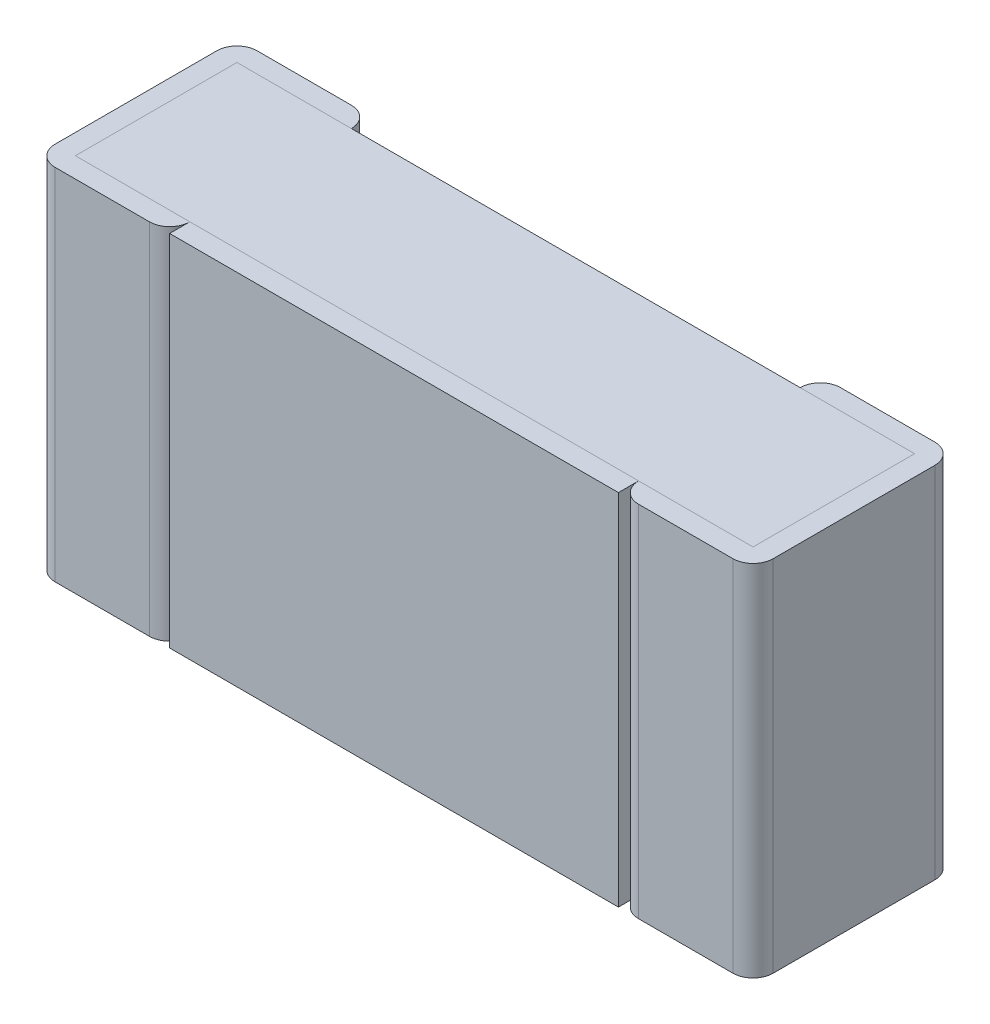
ISO-10303-21;
HEADER;
FILE_DESCRIPTION(('STEP AP214'),'2;1');
FILE_NAME('part.step','',(''),(''),'','','');
FILE_SCHEMA(('AUTOMOTIVE_DESIGN { 1 0 10303 214 1 1 1 1 }'));
ENDSEC;
DATA;
#1=APPLICATION_CONTEXT('core data for automotive mechanical design processes');
#2=APPLICATION_PROTOCOL_DEFINITION('international standard','automotive_design',2000,#1);
#3=PRODUCT_CONTEXT('',#1,'mechanical');
#4=PRODUCT('Part','Part','',(#3));
#5=PRODUCT_RELATED_PRODUCT_CATEGORY('part','',(#4));
#6=PRODUCT_DEFINITION_FORMATION('','',#4);
#7=PRODUCT_DEFINITION_CONTEXT('part definition',#1,'design');
#8=PRODUCT_DEFINITION('design','',#6,#7);
#9=PRODUCT_DEFINITION_SHAPE('','',#8);
#10=(LENGTH_UNIT() NAMED_UNIT(*) SI_UNIT(.MILLI.,.METRE.));
#11=(NAMED_UNIT(*) PLANE_ANGLE_UNIT() SI_UNIT($,.RADIAN.));
#12=(NAMED_UNIT(*) SI_UNIT($,.STERADIAN.) SOLID_ANGLE_UNIT());
#13=UNCERTAINTY_MEASURE_WITH_UNIT(LENGTH_MEASURE(1.E-05),#10,'distance_accuracy_value','');
#14=(GEOMETRIC_REPRESENTATION_CONTEXT(3) GLOBAL_UNCERTAINTY_ASSIGNED_CONTEXT((#13)) GLOBAL_UNIT_ASSIGNED_CONTEXT((#10,
#11,#12)) REPRESENTATION_CONTEXT('',''));
#15=CARTESIAN_POINT('',(0.,0.,0.));
#16=DIRECTION('',(0.,0.,1.));
#17=DIRECTION('',(1.,0.,0.));
#18=AXIS2_PLACEMENT_3D('',#15,#16,#17);
#19=CARTESIAN_POINT('',(-0.5,-0.4,0.45));
#20=DIRECTION('',(0.,0.,1.));
#21=DIRECTION('',(1.,0.,0.));
#22=AXIS2_PLACEMENT_3D('',#19,#20,#21);
#23=PLANE('',#22);
#24=DIRECTION('',(0.,1.,0.));
#25=VECTOR('',#24,1.);
#26=CARTESIAN_POINT('',(-0.5,-0.4,0.45));
#27=LINE('',#26,#25);
#28=CARTESIAN_POINT('',(-0.5,-0.4,0.45));
#29=VERTEX_POINT('',#28);
#30=CARTESIAN_POINT('',(-0.5,0.4,0.45));
#31=VERTEX_POINT('',#30);
#32=EDGE_CURVE('E395',#29,#31,#27,.T.);
#33=ORIENTED_EDGE('',*,*,#32,.F.);
#34=DIRECTION('',(1.,0.,0.));
#35=VECTOR('',#34,1.);
#36=CARTESIAN_POINT('',(-0.5,-0.4,0.45));
#37=LINE('',#36,#35);
#38=CARTESIAN_POINT('',(0.5,-0.4,0.45));
#39=VERTEX_POINT('',#38);
#40=EDGE_CURVE('E355',#29,#39,#37,.T.);
#41=ORIENTED_EDGE('',*,*,#40,.T.);
#42=DIRECTION('',(0.,1.,0.));
#43=VECTOR('',#42,1.);
#44=CARTESIAN_POINT('',(0.5,-0.4,0.45));
#45=LINE('',#44,#43);
#46=CARTESIAN_POINT('',(0.5,0.4,0.45));
#47=VERTEX_POINT('',#46);
#48=EDGE_CURVE('E11',#39,#47,#45,.T.);
#49=ORIENTED_EDGE('',*,*,#48,.T.);
#50=DIRECTION('',(1.,0.,0.));
#51=VECTOR('',#50,1.);
#52=CARTESIAN_POINT('',(-0.5,0.4,0.45));
#53=LINE('',#52,#51);
#54=EDGE_CURVE('E322',#31,#47,#53,.T.);
#55=ORIENTED_EDGE('',*,*,#54,.F.);
#56=EDGE_LOOP('',(#33,#41,#49,#55));
#57=FACE_BOUND('',#56,.T.);
#58=ADVANCED_FACE('F17',(#57),#23,.T.);
#59=CARTESIAN_POINT('',(0.5,-0.4,0.405));
#60=DIRECTION('',(1.,0.,0.));
#61=DIRECTION('',(0.,1.,0.));
#62=AXIS2_PLACEMENT_3D('',#59,#60,#61);
#63=PLANE('',#62);
#64=DIRECTION('',(0.,0.,1.));
#65=VECTOR('',#64,1.);
#66=CARTESIAN_POINT('',(0.5,-0.4,0.405));
#67=LINE('',#66,#65);
#68=CARTESIAN_POINT('',(0.5,-0.4,0.405));
#69=VERTEX_POINT('',#68);
#70=EDGE_CURVE('E351',#69,#39,#67,.T.);
#71=ORIENTED_EDGE('',*,*,#70,.F.);
#72=DIRECTION('',(0.,1.,0.));
#73=VECTOR('',#72,1.);
#74=CARTESIAN_POINT('',(0.5,-0.4,0.405));
#75=LINE('',#74,#73);
#76=CARTESIAN_POINT('',(0.5,0.4,0.405));
#77=VERTEX_POINT('',#76);
#78=EDGE_CURVE('E20',#69,#77,#75,.T.);
#79=ORIENTED_EDGE('',*,*,#78,.T.);
#80=DIRECTION('',(0.,0.,1.));
#81=VECTOR('',#80,1.);
#82=CARTESIAN_POINT('',(0.5,0.4,0.405));
#83=LINE('',#82,#81);
#84=EDGE_CURVE('E318',#77,#47,#83,.T.);
#85=ORIENTED_EDGE('',*,*,#84,.T.);
#86=ORIENTED_EDGE('',*,*,#48,.F.);
#87=EDGE_LOOP('',(#71,#79,#85,#86));
#88=FACE_BOUND('',#87,.T.);
#89=ADVANCED_FACE('F438',(#88),#63,.T.);
#90=CARTESIAN_POINT('',(0.545,-0.4,0.405));
#91=DIRECTION('',(0.,1.,0.));
#92=DIRECTION('',(-1.,0.,0.));
#93=AXIS2_PLACEMENT_3D('',#90,#91,#92);
#94=CYLINDRICAL_SURFACE('',#93,0.045);
#95=CARTESIAN_POINT('',(0.545,-0.4,0.405));
#96=DIRECTION('',(0.,1.,0.));
#97=DIRECTION('',(0.,0.,1.));
#98=AXIS2_PLACEMENT_3D('',#95,#96,#97);
#99=CIRCLE('',#98,0.045);
#100=CARTESIAN_POINT('',(0.545,-0.4,0.45));
#101=VERTEX_POINT('',#100);
#102=EDGE_CURVE('E381',#69,#101,#99,.T.);
#103=ORIENTED_EDGE('',*,*,#102,.T.);
#104=DIRECTION('',(0.,1.,0.));
#105=VECTOR('',#104,1.);
#106=CARTESIAN_POINT('',(0.545,-0.4,0.45));
#107=LINE('',#106,#105);
#108=CARTESIAN_POINT('',(0.545,0.4,0.45));
#109=VERTEX_POINT('',#108);
#110=EDGE_CURVE('E425',#101,#109,#107,.T.);
#111=ORIENTED_EDGE('',*,*,#110,.T.);
#112=CARTESIAN_POINT('',(0.545,0.4,0.405));
#113=DIRECTION('',(0.,1.,0.));
#114=DIRECTION('',(0.,0.,1.));
#115=AXIS2_PLACEMENT_3D('',#112,#113,#114);
#116=CIRCLE('',#115,0.045);
#117=EDGE_CURVE('E323',#77,#109,#116,.T.);
#118=ORIENTED_EDGE('',*,*,#117,.F.);
#119=ORIENTED_EDGE('',*,*,#78,.F.);
#120=EDGE_LOOP('',(#103,#111,#118,#119));
#121=FACE_BOUND('',#120,.T.);
#122=ADVANCED_FACE('F444',(#121),#94,.T.);
#123=CARTESIAN_POINT('',(0.5,-0.4,0.45));
#124=DIRECTION('',(0.,0.,1.));
#125=DIRECTION('',(1.,0.,0.));
#126=AXIS2_PLACEMENT_3D('',#123,#124,#125);
#127=PLANE('',#126);
#128=DIRECTION('',(1.,0.,0.));
#129=VECTOR('',#128,1.);
#130=CARTESIAN_POINT('',(0.5,0.4,0.45));
#131=LINE('',#130,#129);
#132=CARTESIAN_POINT('',(0.755,0.4,0.45));
#133=VERTEX_POINT('',#132);
#134=EDGE_CURVE('E327',#109,#133,#131,.T.);
#135=ORIENTED_EDGE('',*,*,#134,.F.);
#136=ORIENTED_EDGE('',*,*,#110,.F.);
#137=DIRECTION('',(1.,0.,0.));
#138=VECTOR('',#137,1.);
#139=CARTESIAN_POINT('',(0.5,-0.4,0.45));
#140=LINE('',#139,#138);
#141=CARTESIAN_POINT('',(0.755,-0.4,0.45));
#142=VERTEX_POINT('',#141);
#143=EDGE_CURVE('E371',#101,#142,#140,.T.);
#144=ORIENTED_EDGE('',*,*,#143,.T.);
#145=DIRECTION('',(0.,1.,0.));
#146=VECTOR('',#145,1.);
#147=CARTESIAN_POINT('',(0.755,-0.4,0.45));
#148=LINE('',#147,#146);
#149=EDGE_CURVE('E423',#142,#133,#148,.T.);
#150=ORIENTED_EDGE('',*,*,#149,.T.);
#151=EDGE_LOOP('',(#135,#136,#144,#150));
#152=FACE_BOUND('',#151,.T.);
#153=ADVANCED_FACE('F487',(#152),#127,.T.);
#154=CARTESIAN_POINT('',(0.755,-0.4,0.405));
#155=DIRECTION('',(0.,1.,0.));
#156=DIRECTION('',(1.,0.,0.));
#157=AXIS2_PLACEMENT_3D('',#154,#155,#156);
#158=CYLINDRICAL_SURFACE('',#157,0.045);
#159=DIRECTION('',(0.,1.,0.));
#160=VECTOR('',#159,1.);
#161=CARTESIAN_POINT('',(0.8,-0.4,0.405));
#162=LINE('',#161,#160);
#163=CARTESIAN_POINT('',(0.8,-0.4,0.405));
#164=VERTEX_POINT('',#163);
#165=CARTESIAN_POINT('',(0.8,0.4,0.405));
#166=VERTEX_POINT('',#165);
#167=EDGE_CURVE('E422',#164,#166,#162,.T.);
#168=ORIENTED_EDGE('',*,*,#167,.T.);
#169=CARTESIAN_POINT('',(0.755,0.4,0.405));
#170=DIRECTION('',(0.,-1.,0.));
#171=DIRECTION('',(0.,0.,1.));
#172=AXIS2_PLACEMENT_3D('',#169,#170,#171);
#173=CIRCLE('',#172,0.045);
#174=EDGE_CURVE('E410',#166,#133,#173,.T.);
#175=ORIENTED_EDGE('',*,*,#174,.T.);
#176=ORIENTED_EDGE('',*,*,#149,.F.);
#177=CARTESIAN_POINT('',(0.755,-0.4,0.405));
#178=DIRECTION('',(0.,-1.,0.));
#179=DIRECTION('',(0.,0.,1.));
#180=AXIS2_PLACEMENT_3D('',#177,#178,#179);
#181=CIRCLE('',#180,0.045);
#182=EDGE_CURVE('E367',#164,#142,#181,.T.);
#183=ORIENTED_EDGE('',*,*,#182,.F.);
#184=EDGE_LOOP('',(#168,#175,#176,#183));
#185=FACE_BOUND('',#184,.T.);
#186=ADVANCED_FACE('F491',(#185),#158,.T.);
#187=CARTESIAN_POINT('',(0.8,-0.4,0.));
#188=DIRECTION('',(1.,0.,0.));
#189=DIRECTION('',(0.,1.,0.));
#190=AXIS2_PLACEMENT_3D('',#187,#188,#189);
#191=PLANE('',#190);
#192=DIRECTION('',(0.,0.,1.));
#193=VECTOR('',#192,1.);
#194=CARTESIAN_POINT('',(0.8,-0.4,0.));
#195=LINE('',#194,#193);
#196=CARTESIAN_POINT('',(0.8,-0.4,0.045));
#197=VERTEX_POINT('',#196);
#198=EDGE_CURVE('E366',#197,#164,#195,.T.);
#199=ORIENTED_EDGE('',*,*,#198,.F.);
#200=DIRECTION('',(0.,1.,0.));
#201=VECTOR('',#200,1.);
#202=CARTESIAN_POINT('',(0.8,-0.4,0.045));
#203=LINE('',#202,#201);
#204=CARTESIAN_POINT('',(0.8,0.4,0.045));
#205=VERTEX_POINT('',#204);
#206=EDGE_CURVE('E46',#197,#205,#203,.T.);
#207=ORIENTED_EDGE('',*,*,#206,.T.);
#208=DIRECTION('',(0.,0.,1.));
#209=VECTOR('',#208,1.);
#210=CARTESIAN_POINT('',(0.8,0.4,0.));
#211=LINE('',#210,#209);
#212=EDGE_CURVE('E414',#205,#166,#211,.T.);
#213=ORIENTED_EDGE('',*,*,#212,.T.);
#214=ORIENTED_EDGE('',*,*,#167,.F.);
#215=EDGE_LOOP('',(#199,#207,#213,#214));
#216=FACE_BOUND('',#215,.T.);
#217=ADVANCED_FACE('F494',(#216),#191,.T.);
#218=CARTESIAN_POINT('',(0.755,-0.4,0.045));
#219=DIRECTION('',(0.,1.,0.));
#220=DIRECTION('',(1.,0.,0.));
#221=AXIS2_PLACEMENT_3D('',#218,#219,#220);
#222=CYLINDRICAL_SURFACE('',#221,0.045);
#223=CARTESIAN_POINT('',(0.755,-0.4,0.045));
#224=DIRECTION('',(0.,1.,0.));
#225=DIRECTION('',(0.,0.,1.));
#226=AXIS2_PLACEMENT_3D('',#223,#224,#225);
#227=CIRCLE('',#226,0.045);
#228=CARTESIAN_POINT('',(0.755,-0.4,0.));
#229=VERTEX_POINT('',#228);
#230=EDGE_CURVE('E271',#197,#229,#227,.T.);
#231=ORIENTED_EDGE('',*,*,#230,.T.);
#232=DIRECTION('',(0.,1.,0.));
#233=VECTOR('',#232,1.);
#234=CARTESIAN_POINT('',(0.755,-0.4,0.));
#235=LINE('',#234,#233);
#236=CARTESIAN_POINT('',(0.755,0.4,0.));
#237=VERTEX_POINT('',#236);
#238=EDGE_CURVE('E335',#229,#237,#235,.T.);
#239=ORIENTED_EDGE('',*,*,#238,.T.);
#240=CARTESIAN_POINT('',(0.755,0.4,0.045));
#241=DIRECTION('',(0.,1.,0.));
#242=DIRECTION('',(0.,0.,1.));
#243=AXIS2_PLACEMENT_3D('',#240,#241,#242);
#244=CIRCLE('',#243,0.045);
#245=EDGE_CURVE('E377',#205,#237,#244,.T.);
#246=ORIENTED_EDGE('',*,*,#245,.F.);
#247=ORIENTED_EDGE('',*,*,#206,.F.);
#248=EDGE_LOOP('',(#231,#239,#246,#247));
#249=FACE_BOUND('',#248,.T.);
#250=ADVANCED_FACE('F496',(#249),#222,.T.);
#251=CARTESIAN_POINT('',(0.5,-0.4,0.));
#252=DIRECTION('',(0.,0.,1.));
#253=DIRECTION('',(1.,0.,0.));
#254=AXIS2_PLACEMENT_3D('',#251,#252,#253);
#255=PLANE('',#254);
#256=ORIENTED_EDGE('',*,*,#238,.F.);
#257=DIRECTION('',(1.,0.,0.));
#258=VECTOR('',#257,1.);
#259=CARTESIAN_POINT('',(0.5,-0.4,0.));
#260=LINE('',#259,#258);
#261=CARTESIAN_POINT('',(0.545,-0.4,0.));
#262=VERTEX_POINT('',#261);
#263=EDGE_CURVE('E356',#262,#229,#260,.T.);
#264=ORIENTED_EDGE('',*,*,#263,.F.);
#265=DIRECTION('',(0.,1.,0.));
#266=VECTOR('',#265,1.);
#267=CARTESIAN_POINT('',(0.545,-0.4,0.));
#268=LINE('',#267,#266);
#269=CARTESIAN_POINT('',(0.545,0.4,0.));
#270=VERTEX_POINT('',#269);
#271=EDGE_CURVE('E321',#262,#270,#268,.T.);
#272=ORIENTED_EDGE('',*,*,#271,.T.);
#273=DIRECTION('',(1.,0.,0.));
#274=VECTOR('',#273,1.);
#275=CARTESIAN_POINT('',(0.5,0.4,0.));
#276=LINE('',#275,#274);
#277=EDGE_CURVE('E400',#270,#237,#276,.T.);
#278=ORIENTED_EDGE('',*,*,#277,.T.);
#279=EDGE_LOOP('',(#256,#264,#272,#278));
#280=FACE_BOUND('',#279,.T.);
#281=ADVANCED_FACE('F503',(#280),#255,.F.);
#282=CARTESIAN_POINT('',(0.545,-0.4,0.045));
#283=DIRECTION('',(0.,1.,0.));
#284=DIRECTION('',(-1.,0.,0.));
#285=AXIS2_PLACEMENT_3D('',#282,#283,#284);
#286=CYLINDRICAL_SURFACE('',#285,0.045);
#287=DIRECTION('',(0.,1.,0.));
#288=VECTOR('',#287,1.);
#289=CARTESIAN_POINT('',(0.5,-0.4,0.045));
#290=LINE('',#289,#288);
#291=CARTESIAN_POINT('',(0.5,-0.4,0.045));
#292=VERTEX_POINT('',#291);
#293=CARTESIAN_POINT('',(0.5,0.4,0.045));
#294=VERTEX_POINT('',#293);
#295=EDGE_CURVE('E267',#292,#294,#290,.T.);
#296=ORIENTED_EDGE('',*,*,#295,.T.);
#297=CARTESIAN_POINT('',(0.545,0.4,0.045));
#298=DIRECTION('',(0.,-1.,0.));
#299=DIRECTION('',(0.,0.,1.));
#300=AXIS2_PLACEMENT_3D('',#297,#298,#299);
#301=CIRCLE('',#300,0.045);
#302=EDGE_CURVE('E328',#294,#270,#301,.T.);
#303=ORIENTED_EDGE('',*,*,#302,.T.);
#304=ORIENTED_EDGE('',*,*,#271,.F.);
#305=CARTESIAN_POINT('',(0.545,-0.4,0.045));
#306=DIRECTION('',(0.,-1.,0.));
#307=DIRECTION('',(0.,0.,1.));
#308=AXIS2_PLACEMENT_3D('',#305,#306,#307);
#309=CIRCLE('',#308,0.045);
#310=EDGE_CURVE('E382',#292,#262,#309,.T.);
#311=ORIENTED_EDGE('',*,*,#310,.F.);
#312=EDGE_LOOP('',(#296,#303,#304,#311));
#313=FACE_BOUND('',#312,.T.);
#314=ADVANCED_FACE('F522',(#313),#286,.T.);
#315=CARTESIAN_POINT('',(-0.5,0.4,0.405));
#316=DIRECTION('',(0.,1.,0.));
#317=DIRECTION('',(1.,0.,0.));
#318=AXIS2_PLACEMENT_3D('',#315,#316,#317);
#319=PLANE('',#318);
#320=DIRECTION('',(1.,0.,0.));
#321=VECTOR('',#320,1.);
#322=CARTESIAN_POINT('',(-0.5,0.4,0.405));
#323=LINE('',#322,#321);
#324=CARTESIAN_POINT('',(-0.5,0.4,0.405));
#325=VERTEX_POINT('',#324);
#326=EDGE_CURVE('E340',#325,#77,#323,.T.);
#327=ORIENTED_EDGE('',*,*,#326,.F.);
#328=DIRECTION('',(0.,0.,1.));
#329=VECTOR('',#328,1.);
#330=CARTESIAN_POINT('',(-0.5,0.4,0.405));
#331=LINE('',#330,#329);
#332=EDGE_CURVE('E396',#325,#31,#331,.T.);
#333=ORIENTED_EDGE('',*,*,#332,.T.);
#334=ORIENTED_EDGE('',*,*,#54,.T.);
#335=ORIENTED_EDGE('',*,*,#84,.F.);
#336=EDGE_LOOP('',(#327,#333,#334,#335));
#337=FACE_BOUND('',#336,.T.);
#338=ADVANCED_FACE('F442',(#337),#319,.T.);
#339=CARTESIAN_POINT('',(0.5,0.4,0.));
#340=DIRECTION('',(0.,1.,0.));
#341=DIRECTION('',(1.,0.,0.));
#342=AXIS2_PLACEMENT_3D('',#339,#340,#341);
#343=PLANE('',#342);
#344=ORIENTED_EDGE('',*,*,#277,.F.);
#345=ORIENTED_EDGE('',*,*,#302,.F.);
#346=DIRECTION('',(1.,0.,0.));
#347=VECTOR('',#346,1.);
#348=CARTESIAN_POINT('',(-0.755,0.4,0.045));
#349=LINE('',#348,#347);
#350=CARTESIAN_POINT('',(0.755,0.4,0.045));
#351=VERTEX_POINT('',#350);
#352=EDGE_CURVE('E359',#294,#351,#349,.T.);
#353=ORIENTED_EDGE('',*,*,#352,.T.);
#354=DIRECTION('',(0.,0.,1.));
#355=VECTOR('',#354,1.);
#356=CARTESIAN_POINT('',(0.755,0.4,0.045));
#357=LINE('',#356,#355);
#358=CARTESIAN_POINT('',(0.755,0.4,0.405));
#359=VERTEX_POINT('',#358);
#360=EDGE_CURVE('E350',#351,#359,#357,.T.);
#361=ORIENTED_EDGE('',*,*,#360,.T.);
#362=DIRECTION('',(1.,0.,0.));
#363=VECTOR('',#362,1.);
#364=CARTESIAN_POINT('',(-0.755,0.4,0.405));
#365=LINE('',#364,#363);
#366=EDGE_CURVE('E346',#77,#359,#365,.T.);
#367=ORIENTED_EDGE('',*,*,#366,.F.);
#368=ORIENTED_EDGE('',*,*,#117,.T.);
#369=ORIENTED_EDGE('',*,*,#134,.T.);
#370=ORIENTED_EDGE('',*,*,#174,.F.);
#371=ORIENTED_EDGE('',*,*,#212,.F.);
#372=ORIENTED_EDGE('',*,*,#245,.T.);
#373=EDGE_LOOP('',(#344,#345,#353,#361,#367,#368,#369,#370,#371,#372));
#374=FACE_BOUND('',#373,.T.);
#375=ADVANCED_FACE('F447',(#374),#343,.T.);
#376=CARTESIAN_POINT('',(-0.5,-0.4,0.405));
#377=DIRECTION('',(1.,0.,0.));
#378=DIRECTION('',(0.,1.,0.));
#379=AXIS2_PLACEMENT_3D('',#376,#377,#378);
#380=PLANE('',#379);
#381=ORIENTED_EDGE('',*,*,#32,.T.);
#382=ORIENTED_EDGE('',*,*,#332,.F.);
#383=DIRECTION('',(0.,1.,0.));
#384=VECTOR('',#383,1.);
#385=CARTESIAN_POINT('',(-0.5,-0.4,0.405));
#386=LINE('',#385,#384);
#387=CARTESIAN_POINT('',(-0.5,-0.4,0.405));
#388=VERTEX_POINT('',#387);
#389=EDGE_CURVE('E336',#388,#325,#386,.T.);
#390=ORIENTED_EDGE('',*,*,#389,.F.);
#391=DIRECTION('',(0.,0.,1.));
#392=VECTOR('',#391,1.);
#393=CARTESIAN_POINT('',(-0.5,-0.4,0.405));
#394=LINE('',#393,#392);
#395=EDGE_CURVE('E391',#388,#29,#394,.T.);
#396=ORIENTED_EDGE('',*,*,#395,.T.);
#397=EDGE_LOOP('',(#381,#382,#390,#396));
#398=FACE_BOUND('',#397,.T.);
#399=ADVANCED_FACE('F463',(#398),#380,.F.);
#400=CARTESIAN_POINT('',(-0.5,-0.4,0.405));
#401=DIRECTION('',(0.,1.,0.));
#402=DIRECTION('',(1.,0.,0.));
#403=AXIS2_PLACEMENT_3D('',#400,#401,#402);
#404=PLANE('',#403);
#405=ORIENTED_EDGE('',*,*,#70,.T.);
#406=ORIENTED_EDGE('',*,*,#40,.F.);
#407=ORIENTED_EDGE('',*,*,#395,.F.);
#408=DIRECTION('',(1.,0.,0.));
#409=VECTOR('',#408,1.);
#410=CARTESIAN_POINT('',(-0.5,-0.4,0.405));
#411=LINE('',#410,#409);
#412=EDGE_CURVE('E311',#388,#69,#411,.T.);
#413=ORIENTED_EDGE('',*,*,#412,.T.);
#414=EDGE_LOOP('',(#405,#406,#407,#413));
#415=FACE_BOUND('',#414,.T.);
#416=ADVANCED_FACE('F471',(#415),#404,.F.);
#417=CARTESIAN_POINT('',(0.5,-0.4,0.));
#418=DIRECTION('',(0.,1.,0.));
#419=DIRECTION('',(1.,0.,0.));
#420=AXIS2_PLACEMENT_3D('',#417,#418,#419);
#421=PLANE('',#420);
#422=ORIENTED_EDGE('',*,*,#230,.F.);
#423=ORIENTED_EDGE('',*,*,#198,.T.);
#424=ORIENTED_EDGE('',*,*,#182,.T.);
#425=ORIENTED_EDGE('',*,*,#143,.F.);
#426=ORIENTED_EDGE('',*,*,#102,.F.);
#427=DIRECTION('',(1.,0.,0.));
#428=VECTOR('',#427,1.);
#429=CARTESIAN_POINT('',(-0.755,-0.4,0.405));
#430=LINE('',#429,#428);
#431=CARTESIAN_POINT('',(0.755,-0.4,0.405));
#432=VERTEX_POINT('',#431);
#433=EDGE_CURVE('E308',#69,#432,#430,.T.);
#434=ORIENTED_EDGE('',*,*,#433,.T.);
#435=DIRECTION('',(0.,0.,1.));
#436=VECTOR('',#435,1.);
#437=CARTESIAN_POINT('',(0.755,-0.4,0.045));
#438=LINE('',#437,#436);
#439=CARTESIAN_POINT('',(0.755,-0.4,0.045));
#440=VERTEX_POINT('',#439);
#441=EDGE_CURVE('E297',#440,#432,#438,.T.);
#442=ORIENTED_EDGE('',*,*,#441,.F.);
#443=DIRECTION('',(1.,0.,0.));
#444=VECTOR('',#443,1.);
#445=CARTESIAN_POINT('',(-0.755,-0.4,0.045));
#446=LINE('',#445,#444);
#447=EDGE_CURVE('E293',#292,#440,#446,.T.);
#448=ORIENTED_EDGE('',*,*,#447,.F.);
#449=ORIENTED_EDGE('',*,*,#310,.T.);
#450=ORIENTED_EDGE('',*,*,#263,.T.);
#451=EDGE_LOOP('',(#422,#423,#424,#425,#426,#434,#442,#448,#449,#450));
#452=FACE_BOUND('',#451,.T.);
#453=ADVANCED_FACE('F483',(#452),#421,.F.);
#454=CARTESIAN_POINT('',(-0.755,-0.4,0.045));
#455=DIRECTION('',(0.,0.,1.));
#456=DIRECTION('',(1.,0.,0.));
#457=AXIS2_PLACEMENT_3D('',#454,#455,#456);
#458=PLANE('',#457);
#459=DIRECTION('',(1.,0.,0.));
#460=VECTOR('',#459,1.);
#461=CARTESIAN_POINT('',(-0.755,0.4,0.045));
#462=LINE('',#461,#460);
#463=CARTESIAN_POINT('',(-0.5,0.4,0.045));
#464=VERTEX_POINT('',#463);
#465=EDGE_CURVE('E272',#464,#294,#462,.T.);
#466=ORIENTED_EDGE('',*,*,#465,.T.);
#467=ORIENTED_EDGE('',*,*,#295,.F.);
#468=DIRECTION('',(1.,0.,0.));
#469=VECTOR('',#468,1.);
#470=CARTESIAN_POINT('',(-0.755,-0.4,0.045));
#471=LINE('',#470,#469);
#472=CARTESIAN_POINT('',(-0.5,-0.4,0.045));
#473=VERTEX_POINT('',#472);
#474=EDGE_CURVE('E298',#473,#292,#471,.T.);
#475=ORIENTED_EDGE('',*,*,#474,.F.);
#476=DIRECTION('',(0.,1.,0.));
#477=VECTOR('',#476,1.);
#478=CARTESIAN_POINT('',(-0.5,-0.4,0.045));
#479=LINE('',#478,#477);
#480=EDGE_CURVE('E304',#473,#464,#479,.T.);
#481=ORIENTED_EDGE('',*,*,#480,.T.);
#482=EDGE_LOOP('',(#466,#467,#475,#481));
#483=FACE_BOUND('',#482,.T.);
#484=ADVANCED_FACE('F538',(#483),#458,.F.);
#485=CARTESIAN_POINT('',(-0.755,0.4,0.045));
#486=DIRECTION('',(0.,1.,0.));
#487=DIRECTION('',(1.,0.,0.));
#488=AXIS2_PLACEMENT_3D('',#485,#486,#487);
#489=PLANE('',#488);
#490=DIRECTION('',(1.,0.,0.));
#491=VECTOR('',#490,1.);
#492=CARTESIAN_POINT('',(-0.755,0.4,0.045));
#493=LINE('',#492,#491);
#494=CARTESIAN_POINT('',(-0.755,0.4,0.045));
#495=VERTEX_POINT('',#494);
#496=EDGE_CURVE('E290',#495,#464,#493,.T.);
#497=ORIENTED_EDGE('',*,*,#496,.F.);
#498=DIRECTION('',(0.,0.,1.));
#499=VECTOR('',#498,1.);
#500=CARTESIAN_POINT('',(-0.755,0.4,0.045));
#501=LINE('',#500,#499);
#502=CARTESIAN_POINT('',(-0.755,0.4,0.405));
#503=VERTEX_POINT('',#502);
#504=EDGE_CURVE('E287',#495,#503,#501,.T.);
#505=ORIENTED_EDGE('',*,*,#504,.T.);
#506=DIRECTION('',(1.,0.,0.));
#507=VECTOR('',#506,1.);
#508=CARTESIAN_POINT('',(-0.755,0.4,0.405));
#509=LINE('',#508,#507);
#510=EDGE_CURVE('E283',#503,#325,#509,.T.);
#511=ORIENTED_EDGE('',*,*,#510,.T.);
#512=ORIENTED_EDGE('',*,*,#326,.T.);
#513=ORIENTED_EDGE('',*,*,#366,.T.);
#514=ORIENTED_EDGE('',*,*,#360,.F.);
#515=ORIENTED_EDGE('',*,*,#352,.F.);
#516=ORIENTED_EDGE('',*,*,#465,.F.);
#517=EDGE_LOOP('',(#497,#505,#511,#512,#513,#514,#515,#516));
#518=FACE_BOUND('',#517,.T.);
#519=ADVANCED_FACE('F450',(#518),#489,.T.);
#520=CARTESIAN_POINT('',(-0.545,-0.4,0.405));
#521=DIRECTION('',(0.,1.,0.));
#522=DIRECTION('',(1.,0.,0.));
#523=AXIS2_PLACEMENT_3D('',#520,#521,#522);
#524=CYLINDRICAL_SURFACE('',#523,0.045);
#525=ORIENTED_EDGE('',*,*,#389,.T.);
#526=CARTESIAN_POINT('',(-0.545,0.4,0.405));
#527=DIRECTION('',(0.,-1.,0.));
#528=DIRECTION('',(0.,0.,1.));
#529=AXIS2_PLACEMENT_3D('',#526,#527,#528);
#530=CIRCLE('',#529,0.045);
#531=CARTESIAN_POINT('',(-0.545,0.4,0.45));
#532=VERTEX_POINT('',#531);
#533=EDGE_CURVE('E279',#325,#532,#530,.T.);
#534=ORIENTED_EDGE('',*,*,#533,.T.);
#535=DIRECTION('',(0.,1.,0.));
#536=VECTOR('',#535,1.);
#537=CARTESIAN_POINT('',(-0.545,-0.4,0.45));
#538=LINE('',#537,#536);
#539=CARTESIAN_POINT('',(-0.545,-0.4,0.45));
#540=VERTEX_POINT('',#539);
#541=EDGE_CURVE('E332',#540,#532,#538,.T.);
#542=ORIENTED_EDGE('',*,*,#541,.F.);
#543=CARTESIAN_POINT('',(-0.545,-0.4,0.405));
#544=DIRECTION('',(0.,-1.,0.));
#545=DIRECTION('',(0.,0.,1.));
#546=AXIS2_PLACEMENT_3D('',#543,#544,#545);
#547=CIRCLE('',#546,0.045);
#548=EDGE_CURVE('E255',#388,#540,#547,.T.);
#549=ORIENTED_EDGE('',*,*,#548,.F.);
#550=EDGE_LOOP('',(#525,#534,#542,#549));
#551=FACE_BOUND('',#550,.T.);
#552=ADVANCED_FACE('F455',(#551),#524,.T.);
#553=CARTESIAN_POINT('',(-0.8,-0.4,0.45));
#554=DIRECTION('',(0.,0.,1.));
#555=DIRECTION('',(1.,0.,0.));
#556=AXIS2_PLACEMENT_3D('',#553,#554,#555);
#557=PLANE('',#556);
#558=DIRECTION('',(1.,0.,0.));
#559=VECTOR('',#558,1.);
#560=CARTESIAN_POINT('',(-0.8,0.4,0.45));
#561=LINE('',#560,#559);
#562=CARTESIAN_POINT('',(-0.755,0.4,0.45));
#563=VERTEX_POINT('',#562);
#564=EDGE_CURVE('E228',#563,#532,#561,.T.);
#565=ORIENTED_EDGE('',*,*,#564,.F.);
#566=DIRECTION('',(0.,1.,0.));
#567=VECTOR('',#566,1.);
#568=CARTESIAN_POINT('',(-0.755,-0.4,0.45));
#569=LINE('',#568,#567);
#570=CARTESIAN_POINT('',(-0.755,-0.4,0.45));
#571=VERTEX_POINT('',#570);
#572=EDGE_CURVE('E239',#571,#563,#569,.T.);
#573=ORIENTED_EDGE('',*,*,#572,.F.);
#574=DIRECTION('',(1.,0.,0.));
#575=VECTOR('',#574,1.);
#576=CARTESIAN_POINT('',(-0.8,-0.4,0.45));
#577=LINE('',#576,#575);
#578=EDGE_CURVE('E257',#571,#540,#577,.T.);
#579=ORIENTED_EDGE('',*,*,#578,.T.);
#580=ORIENTED_EDGE('',*,*,#541,.T.);
#581=EDGE_LOOP('',(#565,#573,#579,#580));
#582=FACE_BOUND('',#581,.T.);
#583=ADVANCED_FACE('F535',(#582),#557,.T.);
#584=CARTESIAN_POINT('',(-0.755,-0.4,0.045));
#585=DIRECTION('',(0.,1.,0.));
#586=DIRECTION('',(1.,0.,0.));
#587=AXIS2_PLACEMENT_3D('',#584,#585,#586);
#588=PLANE('',#587);
#589=ORIENTED_EDGE('',*,*,#474,.T.);
#590=ORIENTED_EDGE('',*,*,#447,.T.);
#591=ORIENTED_EDGE('',*,*,#441,.T.);
#592=ORIENTED_EDGE('',*,*,#433,.F.);
#593=ORIENTED_EDGE('',*,*,#412,.F.);
#594=DIRECTION('',(1.,0.,0.));
#595=VECTOR('',#594,1.);
#596=CARTESIAN_POINT('',(-0.755,-0.4,0.405));
#597=LINE('',#596,#595);
#598=CARTESIAN_POINT('',(-0.755,-0.4,0.405));
#599=VERTEX_POINT('',#598);
#600=EDGE_CURVE('E468',#599,#388,#597,.T.);
#601=ORIENTED_EDGE('',*,*,#600,.F.);
#602=DIRECTION('',(0.,0.,1.));
#603=VECTOR('',#602,1.);
#604=CARTESIAN_POINT('',(-0.755,-0.4,0.045));
#605=LINE('',#604,#603);
#606=CARTESIAN_POINT('',(-0.755,-0.4,0.045));
#607=VERTEX_POINT('',#606);
#608=EDGE_CURVE('E559',#607,#599,#605,.T.);
#609=ORIENTED_EDGE('',*,*,#608,.F.);
#610=DIRECTION('',(1.,0.,0.));
#611=VECTOR('',#610,1.);
#612=CARTESIAN_POINT('',(-0.755,-0.4,0.045));
#613=LINE('',#612,#611);
#614=EDGE_CURVE('E561',#607,#473,#613,.T.);
#615=ORIENTED_EDGE('',*,*,#614,.T.);
#616=EDGE_LOOP('',(#589,#590,#591,#592,#593,#601,#609,#615));
#617=FACE_BOUND('',#616,.T.);
#618=ADVANCED_FACE('F467',(#617),#588,.F.);
#619=CARTESIAN_POINT('',(-0.545,-0.4,0.045));
#620=DIRECTION('',(0.,1.,0.));
#621=DIRECTION('',(1.,0.,0.));
#622=AXIS2_PLACEMENT_3D('',#619,#620,#621);
#623=CYLINDRICAL_SURFACE('',#622,0.045);
#624=CARTESIAN_POINT('',(-0.545,-0.4,0.045));
#625=DIRECTION('',(0.,1.,0.));
#626=DIRECTION('',(0.,0.,1.));
#627=AXIS2_PLACEMENT_3D('',#624,#625,#626);
#628=CIRCLE('',#627,0.045);
#629=CARTESIAN_POINT('',(-0.545,-0.4,0.));
#630=VERTEX_POINT('',#629);
#631=EDGE_CURVE('E571',#473,#630,#628,.T.);
#632=ORIENTED_EDGE('',*,*,#631,.T.);
#633=DIRECTION('',(0.,1.,0.));
#634=VECTOR('',#633,1.);
#635=CARTESIAN_POINT('',(-0.545,-0.4,0.));
#636=LINE('',#635,#634);
#637=CARTESIAN_POINT('',(-0.545,0.4,0.));
#638=VERTEX_POINT('',#637);
#639=EDGE_CURVE('E301',#630,#638,#636,.T.);
#640=ORIENTED_EDGE('',*,*,#639,.T.);
#641=CARTESIAN_POINT('',(-0.545,0.4,0.045));
#642=DIRECTION('',(0.,1.,0.));
#643=DIRECTION('',(0.,0.,1.));
#644=AXIS2_PLACEMENT_3D('',#641,#642,#643);
#645=CIRCLE('',#644,0.045);
#646=EDGE_CURVE('E225',#464,#638,#645,.T.);
#647=ORIENTED_EDGE('',*,*,#646,.F.);
#648=ORIENTED_EDGE('',*,*,#480,.F.);
#649=EDGE_LOOP('',(#632,#640,#647,#648));
#650=FACE_BOUND('',#649,.T.);
#651=ADVANCED_FACE('F598',(#650),#623,.T.);
#652=CARTESIAN_POINT('',(-0.8,-0.4,0.));
#653=DIRECTION('',(0.,0.,1.));
#654=DIRECTION('',(1.,0.,0.));
#655=AXIS2_PLACEMENT_3D('',#652,#653,#654);
#656=PLANE('',#655);
#657=ORIENTED_EDGE('',*,*,#639,.F.);
#658=DIRECTION('',(1.,0.,0.));
#659=VECTOR('',#658,1.);
#660=CARTESIAN_POINT('',(-0.8,-0.4,0.));
#661=LINE('',#660,#659);
#662=CARTESIAN_POINT('',(-0.755,-0.4,0.));
#663=VERTEX_POINT('',#662);
#664=EDGE_CURVE('E235',#663,#630,#661,.T.);
#665=ORIENTED_EDGE('',*,*,#664,.F.);
#666=DIRECTION('',(0.,1.,0.));
#667=VECTOR('',#666,1.);
#668=CARTESIAN_POINT('',(-0.755,-0.4,0.));
#669=LINE('',#668,#667);
#670=CARTESIAN_POINT('',(-0.755,0.4,0.));
#671=VERTEX_POINT('',#670);
#672=EDGE_CURVE('E232',#663,#671,#669,.T.);
#673=ORIENTED_EDGE('',*,*,#672,.T.);
#674=DIRECTION('',(1.,0.,0.));
#675=VECTOR('',#674,1.);
#676=CARTESIAN_POINT('',(-0.8,0.4,0.));
#677=LINE('',#676,#675);
#678=EDGE_CURVE('E216',#671,#638,#677,.T.);
#679=ORIENTED_EDGE('',*,*,#678,.T.);
#680=EDGE_LOOP('',(#657,#665,#673,#679));
#681=FACE_BOUND('',#680,.T.);
#682=ADVANCED_FACE('F233',(#681),#656,.F.);
#683=CARTESIAN_POINT('',(-0.8,0.4,0.));
#684=DIRECTION('',(0.,1.,0.));
#685=DIRECTION('',(1.,0.,0.));
#686=AXIS2_PLACEMENT_3D('',#683,#684,#685);
#687=PLANE('',#686);
#688=ORIENTED_EDGE('',*,*,#678,.F.);
#689=CARTESIAN_POINT('',(-0.755,0.4,0.045));
#690=DIRECTION('',(0.,-1.,0.));
#691=DIRECTION('',(0.,0.,1.));
#692=AXIS2_PLACEMENT_3D('',#689,#690,#691);
#693=CIRCLE('',#692,0.045);
#694=CARTESIAN_POINT('',(-0.8,0.4,0.045));
#695=VERTEX_POINT('',#694);
#696=EDGE_CURVE('E221',#695,#671,#693,.T.);
#697=ORIENTED_EDGE('',*,*,#696,.F.);
#698=DIRECTION('',(0.,0.,1.));
#699=VECTOR('',#698,1.);
#700=CARTESIAN_POINT('',(-0.8,0.4,0.));
#701=LINE('',#700,#699);
#702=CARTESIAN_POINT('',(-0.8,0.4,0.405));
#703=VERTEX_POINT('',#702);
#704=EDGE_CURVE('E565',#695,#703,#701,.T.);
#705=ORIENTED_EDGE('',*,*,#704,.T.);
#706=CARTESIAN_POINT('',(-0.755,0.4,0.405));
#707=DIRECTION('',(0.,1.,0.));
#708=DIRECTION('',(0.,0.,1.));
#709=AXIS2_PLACEMENT_3D('',#706,#707,#708);
#710=CIRCLE('',#709,0.045);
#711=EDGE_CURVE('E229',#703,#563,#710,.T.);
#712=ORIENTED_EDGE('',*,*,#711,.T.);
#713=ORIENTED_EDGE('',*,*,#564,.T.);
#714=ORIENTED_EDGE('',*,*,#533,.F.);
#715=ORIENTED_EDGE('',*,*,#510,.F.);
#716=ORIENTED_EDGE('',*,*,#504,.F.);
#717=ORIENTED_EDGE('',*,*,#496,.T.);
#718=ORIENTED_EDGE('',*,*,#646,.T.);
#719=EDGE_LOOP('',(#688,#697,#705,#712,#713,#714,#715,#716,#717,#718));
#720=FACE_BOUND('',#719,.T.);
#721=ADVANCED_FACE('F218',(#720),#687,.T.);
#722=CARTESIAN_POINT('',(-0.755,-0.4,0.405));
#723=DIRECTION('',(0.,1.,0.));
#724=DIRECTION('',(-1.,0.,0.));
#725=AXIS2_PLACEMENT_3D('',#722,#723,#724);
#726=CYLINDRICAL_SURFACE('',#725,0.045);
#727=CARTESIAN_POINT('',(-0.755,-0.4,0.405));
#728=DIRECTION('',(0.,1.,0.));
#729=DIRECTION('',(0.,0.,1.));
#730=AXIS2_PLACEMENT_3D('',#727,#728,#729);
#731=CIRCLE('',#730,0.045);
#732=CARTESIAN_POINT('',(-0.8,-0.4,0.405));
#733=VERTEX_POINT('',#732);
#734=EDGE_CURVE('E259',#733,#571,#731,.T.);
#735=ORIENTED_EDGE('',*,*,#734,.T.);
#736=ORIENTED_EDGE('',*,*,#572,.T.);
#737=ORIENTED_EDGE('',*,*,#711,.F.);
#738=DIRECTION('',(0.,1.,0.));
#739=VECTOR('',#738,1.);
#740=CARTESIAN_POINT('',(-0.8,-0.4,0.405));
#741=LINE('',#740,#739);
#742=EDGE_CURVE('E558',#733,#703,#741,.T.);
#743=ORIENTED_EDGE('',*,*,#742,.F.);
#744=EDGE_LOOP('',(#735,#736,#737,#743));
#745=FACE_BOUND('',#744,.T.);
#746=ADVANCED_FACE('F591',(#745),#726,.T.);
#747=CARTESIAN_POINT('',(-0.755,-0.4,0.045));
#748=DIRECTION('',(0.,1.,0.));
#749=DIRECTION('',(-1.,0.,0.));
#750=AXIS2_PLACEMENT_3D('',#747,#748,#749);
#751=CYLINDRICAL_SURFACE('',#750,0.045);
#752=DIRECTION('',(0.,1.,0.));
#753=VECTOR('',#752,1.);
#754=CARTESIAN_POINT('',(-0.8,-0.4,0.045));
#755=LINE('',#754,#753);
#756=CARTESIAN_POINT('',(-0.8,-0.4,0.045));
#757=VERTEX_POINT('',#756);
#758=EDGE_CURVE('E243',#757,#695,#755,.T.);
#759=ORIENTED_EDGE('',*,*,#758,.T.);
#760=ORIENTED_EDGE('',*,*,#696,.T.);
#761=ORIENTED_EDGE('',*,*,#672,.F.);
#762=CARTESIAN_POINT('',(-0.755,-0.4,0.045));
#763=DIRECTION('',(0.,-1.,0.));
#764=DIRECTION('',(0.,0.,1.));
#765=AXIS2_PLACEMENT_3D('',#762,#763,#764);
#766=CIRCLE('',#765,0.045);
#767=EDGE_CURVE('E251',#757,#663,#766,.T.);
#768=ORIENTED_EDGE('',*,*,#767,.F.);
#769=EDGE_LOOP('',(#759,#760,#761,#768));
#770=FACE_BOUND('',#769,.T.);
#771=ADVANCED_FACE('F241',(#770),#751,.T.);
#772=CARTESIAN_POINT('',(-0.8,-0.4,0.));
#773=DIRECTION('',(0.,1.,0.));
#774=DIRECTION('',(1.,0.,0.));
#775=AXIS2_PLACEMENT_3D('',#772,#773,#774);
#776=PLANE('',#775);
#777=ORIENTED_EDGE('',*,*,#631,.F.);
#778=ORIENTED_EDGE('',*,*,#614,.F.);
#779=ORIENTED_EDGE('',*,*,#608,.T.);
#780=ORIENTED_EDGE('',*,*,#600,.T.);
#781=ORIENTED_EDGE('',*,*,#548,.T.);
#782=ORIENTED_EDGE('',*,*,#578,.F.);
#783=ORIENTED_EDGE('',*,*,#734,.F.);
#784=DIRECTION('',(0.,0.,1.));
#785=VECTOR('',#784,1.);
#786=CARTESIAN_POINT('',(-0.8,-0.4,0.));
#787=LINE('',#786,#785);
#788=EDGE_CURVE('E564',#757,#733,#787,.T.);
#789=ORIENTED_EDGE('',*,*,#788,.F.);
#790=ORIENTED_EDGE('',*,*,#767,.T.);
#791=ORIENTED_EDGE('',*,*,#664,.T.);
#792=EDGE_LOOP('',(#777,#778,#779,#780,#781,#782,#783,#789,#790,#791));
#793=FACE_BOUND('',#792,.T.);
#794=ADVANCED_FACE('F584',(#793),#776,.F.);
#795=CARTESIAN_POINT('',(-0.8,-0.4,0.));
#796=DIRECTION('',(1.,0.,0.));
#797=DIRECTION('',(0.,1.,0.));
#798=AXIS2_PLACEMENT_3D('',#795,#796,#797);
#799=PLANE('',#798);
#800=ORIENTED_EDGE('',*,*,#742,.T.);
#801=ORIENTED_EDGE('',*,*,#704,.F.);
#802=ORIENTED_EDGE('',*,*,#758,.F.);
#803=ORIENTED_EDGE('',*,*,#788,.T.);
#804=EDGE_LOOP('',(#800,#801,#802,#803));
#805=FACE_BOUND('',#804,.T.);
#806=ADVANCED_FACE('F589',(#805),#799,.F.);
#807=CLOSED_SHELL('',(#58,#89,#122,#153,#186,#217,#250,#281,#314,#338,#375,#399,#416,#453,#484,
#519,#552,#583,#618,#651,#682,#721,#746,#771,#794,#806));
#808=MANIFOLD_SOLID_BREP('B1',#807);
#809=ADVANCED_BREP_SHAPE_REPRESENTATION('',(#18,#808),#14);
#810=SHAPE_DEFINITION_REPRESENTATION(#9,#809);
ENDSEC;
END-ISO-10303-21;
